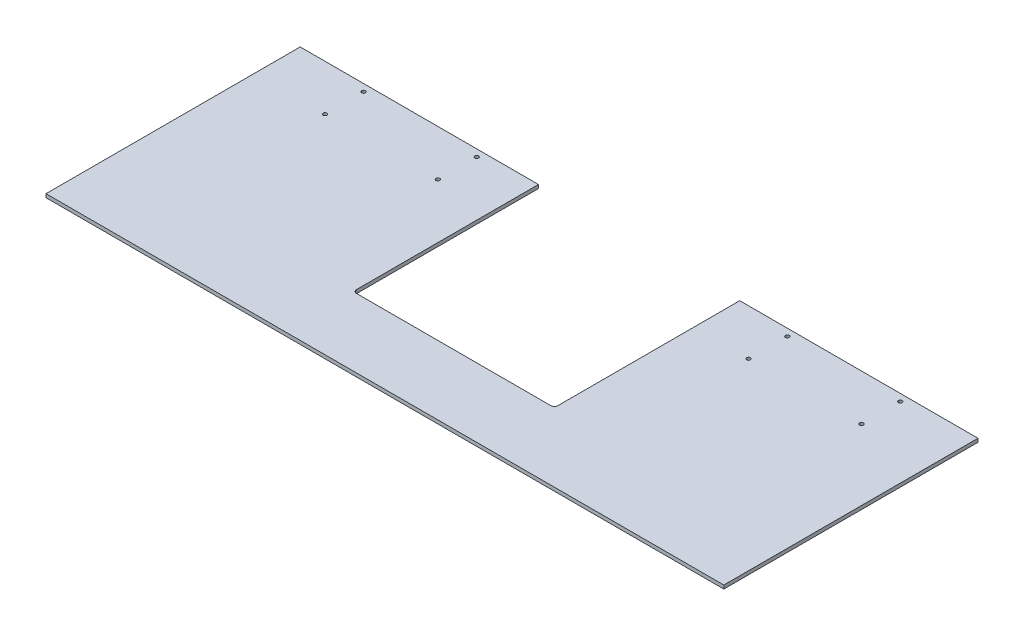
ISO-10303-21;
HEADER;
FILE_DESCRIPTION(('STEP AP214'),'2;1');
FILE_NAME('part.step','',(''),(''),'','','');
FILE_SCHEMA(('AUTOMOTIVE_DESIGN { 1 0 10303 214 1 1 1 1 }'));
ENDSEC;
DATA;
#1=APPLICATION_CONTEXT('core data for automotive mechanical design processes');
#2=APPLICATION_PROTOCOL_DEFINITION('international standard','automotive_design',2000,#1);
#3=PRODUCT_CONTEXT('',#1,'mechanical');
#4=PRODUCT('Part','Part','',(#3));
#5=PRODUCT_RELATED_PRODUCT_CATEGORY('part','',(#4));
#6=PRODUCT_DEFINITION_FORMATION('','',#4);
#7=PRODUCT_DEFINITION_CONTEXT('part definition',#1,'design');
#8=PRODUCT_DEFINITION('design','',#6,#7);
#9=PRODUCT_DEFINITION_SHAPE('','',#8);
#10=(LENGTH_UNIT() NAMED_UNIT(*) SI_UNIT(.MILLI.,.METRE.));
#11=(NAMED_UNIT(*) PLANE_ANGLE_UNIT() SI_UNIT($,.RADIAN.));
#12=(NAMED_UNIT(*) SI_UNIT($,.STERADIAN.) SOLID_ANGLE_UNIT());
#13=UNCERTAINTY_MEASURE_WITH_UNIT(LENGTH_MEASURE(1.E-05),#10,'distance_accuracy_value','');
#14=(GEOMETRIC_REPRESENTATION_CONTEXT(3) GLOBAL_UNCERTAINTY_ASSIGNED_CONTEXT((#13)) GLOBAL_UNIT_ASSIGNED_CONTEXT((#10,
#11,#12)) REPRESENTATION_CONTEXT('',''));
#15=CARTESIAN_POINT('',(0.,0.,0.));
#16=DIRECTION('',(0.,0.,1.));
#17=DIRECTION('',(1.,0.,0.));
#18=AXIS2_PLACEMENT_3D('',#15,#16,#17);
#19=CARTESIAN_POINT('',(609.6,-6.35,-432.563424110412));
#20=DIRECTION('',(0.,0.,1.));
#21=DIRECTION('',(1.,0.,0.));
#22=AXIS2_PLACEMENT_3D('',#19,#20,#21);
#23=PLANE('',#22);
#24=DIRECTION('',(0.,-1.,0.));
#25=VECTOR('',#24,1.);
#26=CARTESIAN_POINT('',(790.575,1340.49866482759,-432.563424110412));
#27=LINE('',#26,#25);
#28=CARTESIAN_POINT('',(790.575,0.,-432.563424110412));
#29=VERTEX_POINT('',#28);
#30=CARTESIAN_POINT('',(790.575,-6.35,-432.563424110412));
#31=VERTEX_POINT('',#30);
#32=EDGE_CURVE('E125',#29,#31,#27,.T.);
#33=ORIENTED_EDGE('',*,*,#32,.F.);
#34=DIRECTION('',(1.,0.,0.));
#35=VECTOR('',#34,1.);
#36=CARTESIAN_POINT('',(609.6,0.,-432.563424110412));
#37=LINE('',#36,#35);
#38=CARTESIAN_POINT('',(1219.2,0.,-432.563424110412));
#39=VERTEX_POINT('',#38);
#40=EDGE_CURVE('E164',#29,#39,#37,.T.);
#41=ORIENTED_EDGE('',*,*,#40,.T.);
#42=DIRECTION('',(0.,1.,0.));
#43=VECTOR('',#42,1.);
#44=CARTESIAN_POINT('',(1219.2,-6.35,-432.563424110412));
#45=LINE('',#44,#43);
#46=CARTESIAN_POINT('',(1219.2,-6.35,-432.563424110412));
#47=VERTEX_POINT('',#46);
#48=EDGE_CURVE('E174',#47,#39,#45,.T.);
#49=ORIENTED_EDGE('',*,*,#48,.F.);
#50=DIRECTION('',(1.,0.,0.));
#51=VECTOR('',#50,1.);
#52=CARTESIAN_POINT('',(609.6,-6.35,-432.563424110412));
#53=LINE('',#52,#51);
#54=EDGE_CURVE('E146',#31,#47,#53,.T.);
#55=ORIENTED_EDGE('',*,*,#54,.F.);
#56=EDGE_LOOP('',(#33,#41,#49,#55));
#57=FACE_BOUND('',#56,.T.);
#58=ADVANCED_FACE('F14',(#57),#23,.F.);
#59=CARTESIAN_POINT('',(609.6,-6.35,-203.963424110413));
#60=DIRECTION('',(0.,-1.,0.));
#61=DIRECTION('',(1.,0.,0.));
#62=AXIS2_PLACEMENT_3D('',#59,#60,#61);
#63=PLANE('',#62);
#64=CARTESIAN_POINT('',(1092.2,-6.35000000000008,-350.013424110413));
#65=DIRECTION('',(0.,-1.,0.));
#66=DIRECTION('',(0.,0.,-1.));
#67=AXIS2_PLACEMENT_3D('',#64,#65,#66);
#68=CIRCLE('',#67,3.36549999999991);
#69=CARTESIAN_POINT('',(1092.2,-6.35000000000008,-353.378924110413));
#70=VERTEX_POINT('',#69);
#71=EDGE_CURVE('E235',#70,#70,#68,.T.);
#72=ORIENTED_EDGE('',*,*,#71,.F.);
#73=EDGE_LOOP('',(#72));
#74=FACE_BOUND('',#73,.T.);
#75=CARTESIAN_POINT('',(1092.2,-6.35000000000008,-419.863424110413));
#76=DIRECTION('',(0.,-1.,0.));
#77=DIRECTION('',(0.,0.,-1.));
#78=AXIS2_PLACEMENT_3D('',#75,#76,#77);
#79=CIRCLE('',#78,3.36549999999991);
#80=CARTESIAN_POINT('',(1092.2,-6.35000000000008,-423.228924110413));
#81=VERTEX_POINT('',#80);
#82=EDGE_CURVE('E230',#81,#81,#79,.T.);
#83=ORIENTED_EDGE('',*,*,#82,.F.);
#84=EDGE_LOOP('',(#83));
#85=FACE_BOUND('',#84,.T.);
#86=CARTESIAN_POINT('',(889.,-6.35000000000008,-419.863424110412));
#87=DIRECTION('',(0.,-1.,0.));
#88=DIRECTION('',(0.,0.,-1.));
#89=AXIS2_PLACEMENT_3D('',#86,#87,#88);
#90=CIRCLE('',#89,3.3655);
#91=CARTESIAN_POINT('',(889.,-6.35000000000008,-423.228924110412));
#92=VERTEX_POINT('',#91);
#93=EDGE_CURVE('E225',#92,#92,#90,.T.);
#94=ORIENTED_EDGE('',*,*,#93,.F.);
#95=EDGE_LOOP('',(#94));
#96=FACE_BOUND('',#95,.T.);
#97=CARTESIAN_POINT('',(889.,-6.35000000000008,-350.013424110413));
#98=DIRECTION('',(0.,-1.,0.));
#99=DIRECTION('',(0.,0.,-1.));
#100=AXIS2_PLACEMENT_3D('',#97,#98,#99);
#101=CIRCLE('',#100,3.3655);
#102=CARTESIAN_POINT('',(889.,-6.35000000000008,-353.378924110413));
#103=VERTEX_POINT('',#102);
#104=EDGE_CURVE('E220',#103,#103,#101,.T.);
#105=ORIENTED_EDGE('',*,*,#104,.F.);
#106=EDGE_LOOP('',(#105));
#107=FACE_BOUND('',#106,.T.);
#108=CARTESIAN_POINT('',(330.2,-6.35000000000008,-350.013424110413));
#109=DIRECTION('',(0.,-1.,0.));
#110=DIRECTION('',(0.,0.,-1.));
#111=AXIS2_PLACEMENT_3D('',#108,#109,#110);
#112=CIRCLE('',#111,3.3655);
#113=CARTESIAN_POINT('',(330.2,-6.35000000000008,-353.378924110413));
#114=VERTEX_POINT('',#113);
#115=EDGE_CURVE('E215',#114,#114,#112,.T.);
#116=ORIENTED_EDGE('',*,*,#115,.F.);
#117=EDGE_LOOP('',(#116));
#118=FACE_BOUND('',#117,.T.);
#119=CARTESIAN_POINT('',(330.2,-6.35000000000008,-419.863424110412));
#120=DIRECTION('',(0.,-1.,0.));
#121=DIRECTION('',(0.,0.,-1.));
#122=AXIS2_PLACEMENT_3D('',#119,#120,#121);
#123=CIRCLE('',#122,3.3655);
#124=CARTESIAN_POINT('',(330.2,-6.35000000000008,-423.228924110412));
#125=VERTEX_POINT('',#124);
#126=EDGE_CURVE('E210',#125,#125,#123,.T.);
#127=ORIENTED_EDGE('',*,*,#126,.F.);
#128=EDGE_LOOP('',(#127));
#129=FACE_BOUND('',#128,.T.);
#130=CARTESIAN_POINT('',(127.,-6.35000000000008,-419.863424110412));
#131=DIRECTION('',(0.,-1.,0.));
#132=DIRECTION('',(0.,0.,-1.));
#133=AXIS2_PLACEMENT_3D('',#130,#131,#132);
#134=CIRCLE('',#133,3.3655);
#135=CARTESIAN_POINT('',(127.,-6.35000000000008,-423.228924110412));
#136=VERTEX_POINT('',#135);
#137=EDGE_CURVE('E205',#136,#136,#134,.T.);
#138=ORIENTED_EDGE('',*,*,#137,.F.);
#139=EDGE_LOOP('',(#138));
#140=FACE_BOUND('',#139,.T.);
#141=CARTESIAN_POINT('',(127.,-6.35000000000008,-350.013424110413));
#142=DIRECTION('',(0.,-1.,0.));
#143=DIRECTION('',(0.,0.,-1.));
#144=AXIS2_PLACEMENT_3D('',#141,#142,#143);
#145=CIRCLE('',#144,3.3655);
#146=CARTESIAN_POINT('',(127.,-6.35000000000008,-353.378924110413));
#147=VERTEX_POINT('',#146);
#148=EDGE_CURVE('E200',#147,#147,#145,.T.);
#149=ORIENTED_EDGE('',*,*,#148,.F.);
#150=EDGE_LOOP('',(#149));
#151=FACE_BOUND('',#150,.T.);
#152=DIRECTION('',(0.,0.,1.));
#153=VECTOR('',#152,1.);
#154=CARTESIAN_POINT('',(428.625,-6.35,-282.531552016735));
#155=LINE('',#154,#153);
#156=CARTESIAN_POINT('',(428.625,-6.35,-432.563424110412));
#157=VERTEX_POINT('',#156);
#158=CARTESIAN_POINT('',(428.625,-6.35,-105.538424110413));
#159=VERTEX_POINT('',#158);
#160=EDGE_CURVE('E117',#157,#159,#155,.T.);
#161=ORIENTED_EDGE('',*,*,#160,.T.);
#162=CARTESIAN_POINT('',(434.975,-6.35000000000008,-105.538424110413));
#163=DIRECTION('',(0.,-1.,0.));
#164=DIRECTION('',(0.,0.,-1.));
#165=AXIS2_PLACEMENT_3D('',#162,#163,#164);
#166=CIRCLE('',#165,6.35);
#167=CARTESIAN_POINT('',(434.975,-6.35,-99.1884241104126));
#168=VERTEX_POINT('',#167);
#169=EDGE_CURVE('E23',#159,#168,#166,.F.);
#170=ORIENTED_EDGE('',*,*,#169,.T.);
#171=DIRECTION('',(1.,0.,0.));
#172=VECTOR('',#171,1.);
#173=CARTESIAN_POINT('',(475.085129356384,-6.35,-99.1884241104126));
#174=LINE('',#173,#172);
#175=CARTESIAN_POINT('',(784.225,-6.35,-99.1884241104126));
#176=VERTEX_POINT('',#175);
#177=EDGE_CURVE('E126',#168,#176,#174,.T.);
#178=ORIENTED_EDGE('',*,*,#177,.T.);
#179=CARTESIAN_POINT('',(784.225,-6.35000000000008,-105.538424110413));
#180=DIRECTION('',(0.,-1.,0.));
#181=DIRECTION('',(0.,0.,-1.));
#182=AXIS2_PLACEMENT_3D('',#179,#180,#181);
#183=CIRCLE('',#182,6.35);
#184=CARTESIAN_POINT('',(790.575,-6.35,-105.538424110413));
#185=VERTEX_POINT('',#184);
#186=EDGE_CURVE('E247',#176,#185,#183,.F.);
#187=ORIENTED_EDGE('',*,*,#186,.T.);
#188=DIRECTION('',(0.,0.,-1.));
#189=VECTOR('',#188,1.);
#190=CARTESIAN_POINT('',(790.575,-6.35,-258.876107633114));
#191=LINE('',#190,#189);
#192=EDGE_CURVE('E199',#185,#31,#191,.T.);
#193=ORIENTED_EDGE('',*,*,#192,.T.);
#194=ORIENTED_EDGE('',*,*,#54,.T.);
#195=DIRECTION('',(0.,0.,-1.));
#196=VECTOR('',#195,1.);
#197=CARTESIAN_POINT('',(1219.2,-6.35,-203.963424110413));
#198=LINE('',#197,#196);
#199=CARTESIAN_POINT('',(1219.2,-6.35,24.6365758895875));
#200=VERTEX_POINT('',#199);
#201=EDGE_CURVE('E145',#200,#47,#198,.T.);
#202=ORIENTED_EDGE('',*,*,#201,.F.);
#203=DIRECTION('',(1.,0.,0.));
#204=VECTOR('',#203,1.);
#205=CARTESIAN_POINT('',(609.6,-6.35,24.6365758895875));
#206=LINE('',#205,#204);
#207=CARTESIAN_POINT('',(0.,-6.35,24.6365758895875));
#208=VERTEX_POINT('',#207);
#209=EDGE_CURVE('E171',#208,#200,#206,.T.);
#210=ORIENTED_EDGE('',*,*,#209,.F.);
#211=DIRECTION('',(0.,0.,-1.));
#212=VECTOR('',#211,1.);
#213=CARTESIAN_POINT('',(0.,-6.35,-203.963424110413));
#214=LINE('',#213,#212);
#215=CARTESIAN_POINT('',(0.,-6.35,-432.563424110412));
#216=VERTEX_POINT('',#215);
#217=EDGE_CURVE('E142',#208,#216,#214,.T.);
#218=ORIENTED_EDGE('',*,*,#217,.T.);
#219=EDGE_CURVE('E133',#216,#157,#53,.T.);
#220=ORIENTED_EDGE('',*,*,#219,.T.);
#221=EDGE_LOOP('',(#161,#170,#178,#187,#193,#194,#202,#210,#218,#220));
#222=FACE_BOUND('',#221,.T.);
#223=ADVANCED_FACE('F139',(#74,#85,#96,#107,#118,#129,#140,#151,#222),#63,.T.);
#224=CARTESIAN_POINT('',(609.6,0.,-203.963424110413));
#225=DIRECTION('',(0.,-1.,0.));
#226=DIRECTION('',(1.,0.,0.));
#227=AXIS2_PLACEMENT_3D('',#224,#225,#226);
#228=PLANE('',#227);
#229=CARTESIAN_POINT('',(1092.2,0.,-350.013424110413));
#230=DIRECTION('',(0.,-1.,0.));
#231=DIRECTION('',(0.,0.,-1.));
#232=AXIS2_PLACEMENT_3D('',#229,#230,#231);
#233=CIRCLE('',#232,3.36549999999991);
#234=CARTESIAN_POINT('',(1092.2,0.,-353.378924110413));
#235=VERTEX_POINT('',#234);
#236=EDGE_CURVE('E231',#235,#235,#233,.F.);
#237=ORIENTED_EDGE('',*,*,#236,.F.);
#238=EDGE_LOOP('',(#237));
#239=FACE_BOUND('',#238,.T.);
#240=CARTESIAN_POINT('',(1092.2,0.,-419.863424110413));
#241=DIRECTION('',(0.,-1.,0.));
#242=DIRECTION('',(0.,0.,-1.));
#243=AXIS2_PLACEMENT_3D('',#240,#241,#242);
#244=CIRCLE('',#243,3.36549999999991);
#245=CARTESIAN_POINT('',(1092.2,0.,-423.228924110413));
#246=VERTEX_POINT('',#245);
#247=EDGE_CURVE('E226',#246,#246,#244,.F.);
#248=ORIENTED_EDGE('',*,*,#247,.F.);
#249=EDGE_LOOP('',(#248));
#250=FACE_BOUND('',#249,.T.);
#251=CARTESIAN_POINT('',(889.,0.,-419.863424110412));
#252=DIRECTION('',(0.,-1.,0.));
#253=DIRECTION('',(0.,0.,-1.));
#254=AXIS2_PLACEMENT_3D('',#251,#252,#253);
#255=CIRCLE('',#254,3.3655);
#256=CARTESIAN_POINT('',(889.,0.,-423.228924110412));
#257=VERTEX_POINT('',#256);
#258=EDGE_CURVE('E221',#257,#257,#255,.F.);
#259=ORIENTED_EDGE('',*,*,#258,.F.);
#260=EDGE_LOOP('',(#259));
#261=FACE_BOUND('',#260,.T.);
#262=CARTESIAN_POINT('',(889.,0.,-350.013424110413));
#263=DIRECTION('',(0.,-1.,0.));
#264=DIRECTION('',(0.,0.,-1.));
#265=AXIS2_PLACEMENT_3D('',#262,#263,#264);
#266=CIRCLE('',#265,3.3655);
#267=CARTESIAN_POINT('',(889.,0.,-353.378924110413));
#268=VERTEX_POINT('',#267);
#269=EDGE_CURVE('E216',#268,#268,#266,.F.);
#270=ORIENTED_EDGE('',*,*,#269,.F.);
#271=EDGE_LOOP('',(#270));
#272=FACE_BOUND('',#271,.T.);
#273=CARTESIAN_POINT('',(330.2,0.,-350.013424110413));
#274=DIRECTION('',(0.,-1.,0.));
#275=DIRECTION('',(0.,0.,-1.));
#276=AXIS2_PLACEMENT_3D('',#273,#274,#275);
#277=CIRCLE('',#276,3.3655);
#278=CARTESIAN_POINT('',(330.2,0.,-353.378924110413));
#279=VERTEX_POINT('',#278);
#280=EDGE_CURVE('E211',#279,#279,#277,.F.);
#281=ORIENTED_EDGE('',*,*,#280,.F.);
#282=EDGE_LOOP('',(#281));
#283=FACE_BOUND('',#282,.T.);
#284=CARTESIAN_POINT('',(330.2,0.,-419.863424110412));
#285=DIRECTION('',(0.,-1.,0.));
#286=DIRECTION('',(0.,0.,-1.));
#287=AXIS2_PLACEMENT_3D('',#284,#285,#286);
#288=CIRCLE('',#287,3.3655);
#289=CARTESIAN_POINT('',(330.2,0.,-423.228924110412));
#290=VERTEX_POINT('',#289);
#291=EDGE_CURVE('E206',#290,#290,#288,.F.);
#292=ORIENTED_EDGE('',*,*,#291,.F.);
#293=EDGE_LOOP('',(#292));
#294=FACE_BOUND('',#293,.T.);
#295=CARTESIAN_POINT('',(127.,0.,-419.863424110412));
#296=DIRECTION('',(0.,-1.,0.));
#297=DIRECTION('',(0.,0.,-1.));
#298=AXIS2_PLACEMENT_3D('',#295,#296,#297);
#299=CIRCLE('',#298,3.3655);
#300=CARTESIAN_POINT('',(127.,0.,-423.228924110412));
#301=VERTEX_POINT('',#300);
#302=EDGE_CURVE('E201',#301,#301,#299,.F.);
#303=ORIENTED_EDGE('',*,*,#302,.F.);
#304=EDGE_LOOP('',(#303));
#305=FACE_BOUND('',#304,.T.);
#306=CARTESIAN_POINT('',(127.,0.,-350.013424110413));
#307=DIRECTION('',(0.,-1.,0.));
#308=DIRECTION('',(0.,0.,-1.));
#309=AXIS2_PLACEMENT_3D('',#306,#307,#308);
#310=CIRCLE('',#309,3.3655);
#311=CARTESIAN_POINT('',(127.,0.,-353.378924110413));
#312=VERTEX_POINT('',#311);
#313=EDGE_CURVE('E195',#312,#312,#310,.F.);
#314=ORIENTED_EDGE('',*,*,#313,.F.);
#315=EDGE_LOOP('',(#314));
#316=FACE_BOUND('',#315,.T.);
#317=DIRECTION('',(0.,0.,-1.));
#318=VECTOR('',#317,1.);
#319=CARTESIAN_POINT('',(790.575,0.,-203.963424110413));
#320=LINE('',#319,#318);
#321=CARTESIAN_POINT('',(790.575,0.,-105.538424110413));
#322=VERTEX_POINT('',#321);
#323=EDGE_CURVE('E191',#322,#29,#320,.T.);
#324=ORIENTED_EDGE('',*,*,#323,.F.);
#325=CARTESIAN_POINT('',(784.225,0.,-105.538424110413));
#326=DIRECTION('',(0.,-1.,0.));
#327=DIRECTION('',(0.,0.,-1.));
#328=AXIS2_PLACEMENT_3D('',#325,#326,#327);
#329=CIRCLE('',#328,6.35);
#330=CARTESIAN_POINT('',(784.225,0.,-99.1884241104126));
#331=VERTEX_POINT('',#330);
#332=EDGE_CURVE('E250',#322,#331,#329,.T.);
#333=ORIENTED_EDGE('',*,*,#332,.T.);
#334=DIRECTION('',(1.,0.,0.));
#335=VECTOR('',#334,1.);
#336=CARTESIAN_POINT('',(609.6,0.,-99.1884241104126));
#337=LINE('',#336,#335);
#338=CARTESIAN_POINT('',(434.975,0.,-99.1884241104126));
#339=VERTEX_POINT('',#338);
#340=EDGE_CURVE('E187',#339,#331,#337,.T.);
#341=ORIENTED_EDGE('',*,*,#340,.F.);
#342=CARTESIAN_POINT('',(434.975,0.,-105.538424110413));
#343=DIRECTION('',(0.,-1.,0.));
#344=DIRECTION('',(0.,0.,-1.));
#345=AXIS2_PLACEMENT_3D('',#342,#343,#344);
#346=CIRCLE('',#345,6.35);
#347=CARTESIAN_POINT('',(428.625,0.,-105.538424110413));
#348=VERTEX_POINT('',#347);
#349=EDGE_CURVE('E9',#339,#348,#346,.T.);
#350=ORIENTED_EDGE('',*,*,#349,.T.);
#351=DIRECTION('',(0.,0.,1.));
#352=VECTOR('',#351,1.);
#353=CARTESIAN_POINT('',(428.625,0.,-203.963424110413));
#354=LINE('',#353,#352);
#355=CARTESIAN_POINT('',(428.625,0.,-432.563424110412));
#356=VERTEX_POINT('',#355);
#357=EDGE_CURVE('E184',#356,#348,#354,.T.);
#358=ORIENTED_EDGE('',*,*,#357,.F.);
#359=CARTESIAN_POINT('',(0.,0.,-432.563424110412));
#360=VERTEX_POINT('',#359);
#361=EDGE_CURVE('E135',#360,#356,#37,.T.);
#362=ORIENTED_EDGE('',*,*,#361,.F.);
#363=DIRECTION('',(0.,0.,-1.));
#364=VECTOR('',#363,1.);
#365=CARTESIAN_POINT('',(0.,0.,-203.963424110413));
#366=LINE('',#365,#364);
#367=CARTESIAN_POINT('',(0.,0.,24.6365758895875));
#368=VERTEX_POINT('',#367);
#369=EDGE_CURVE('E161',#368,#360,#366,.T.);
#370=ORIENTED_EDGE('',*,*,#369,.F.);
#371=DIRECTION('',(1.,0.,0.));
#372=VECTOR('',#371,1.);
#373=CARTESIAN_POINT('',(609.6,0.,24.6365758895875));
#374=LINE('',#373,#372);
#375=CARTESIAN_POINT('',(1219.2,0.,24.6365758895875));
#376=VERTEX_POINT('',#375);
#377=EDGE_CURVE('E137',#368,#376,#374,.T.);
#378=ORIENTED_EDGE('',*,*,#377,.T.);
#379=DIRECTION('',(0.,0.,-1.));
#380=VECTOR('',#379,1.);
#381=CARTESIAN_POINT('',(1219.2,0.,-203.963424110413));
#382=LINE('',#381,#380);
#383=EDGE_CURVE('E167',#376,#39,#382,.T.);
#384=ORIENTED_EDGE('',*,*,#383,.T.);
#385=ORIENTED_EDGE('',*,*,#40,.F.);
#386=EDGE_LOOP('',(#324,#333,#341,#350,#358,#362,#370,#378,#384,#385));
#387=FACE_BOUND('',#386,.T.);
#388=ADVANCED_FACE('F275',(#239,#250,#261,#272,#283,#294,#305,#316,#387),#228,.F.);
#389=CARTESIAN_POINT('',(609.6,-6.35,24.6365758895875));
#390=DIRECTION('',(0.,0.,1.));
#391=DIRECTION('',(1.,0.,0.));
#392=AXIS2_PLACEMENT_3D('',#389,#390,#391);
#393=PLANE('',#392);
#394=ORIENTED_EDGE('',*,*,#377,.F.);
#395=DIRECTION('',(0.,1.,0.));
#396=VECTOR('',#395,1.);
#397=CARTESIAN_POINT('',(0.,-6.35,24.6365758895875));
#398=LINE('',#397,#396);
#399=EDGE_CURVE('E181',#208,#368,#398,.T.);
#400=ORIENTED_EDGE('',*,*,#399,.F.);
#401=ORIENTED_EDGE('',*,*,#209,.T.);
#402=DIRECTION('',(0.,1.,0.));
#403=VECTOR('',#402,1.);
#404=CARTESIAN_POINT('',(1219.2,-6.35,24.6365758895875));
#405=LINE('',#404,#403);
#406=EDGE_CURVE('E153',#200,#376,#405,.T.);
#407=ORIENTED_EDGE('',*,*,#406,.T.);
#408=EDGE_LOOP('',(#394,#400,#401,#407));
#409=FACE_BOUND('',#408,.T.);
#410=ADVANCED_FACE('F290',(#409),#393,.T.);
#411=CARTESIAN_POINT('',(0.,-6.35,-203.963424110413));
#412=DIRECTION('',(1.,0.,0.));
#413=DIRECTION('',(0.,0.,-1.));
#414=AXIS2_PLACEMENT_3D('',#411,#412,#413);
#415=PLANE('',#414);
#416=ORIENTED_EDGE('',*,*,#369,.T.);
#417=DIRECTION('',(0.,1.,0.));
#418=VECTOR('',#417,1.);
#419=CARTESIAN_POINT('',(0.,-6.35,-432.563424110412));
#420=LINE('',#419,#418);
#421=EDGE_CURVE('E178',#216,#360,#420,.T.);
#422=ORIENTED_EDGE('',*,*,#421,.F.);
#423=ORIENTED_EDGE('',*,*,#217,.F.);
#424=ORIENTED_EDGE('',*,*,#399,.T.);
#425=EDGE_LOOP('',(#416,#422,#423,#424));
#426=FACE_BOUND('',#425,.T.);
#427=ADVANCED_FACE('F283',(#426),#415,.F.);
#428=ORIENTED_EDGE('',*,*,#361,.T.);
#429=DIRECTION('',(0.,-1.,0.));
#430=VECTOR('',#429,1.);
#431=CARTESIAN_POINT('',(428.625,1340.49866482759,-432.563424110412));
#432=LINE('',#431,#430);
#433=EDGE_CURVE('E120',#356,#157,#432,.T.);
#434=ORIENTED_EDGE('',*,*,#433,.T.);
#435=ORIENTED_EDGE('',*,*,#219,.F.);
#436=ORIENTED_EDGE('',*,*,#421,.T.);
#437=EDGE_LOOP('',(#428,#434,#435,#436));
#438=FACE_BOUND('',#437,.T.);
#439=ADVANCED_FACE('F131',(#438),#23,.F.);
#440=CARTESIAN_POINT('',(1219.2,-6.35,-203.963424110413));
#441=DIRECTION('',(1.,0.,0.));
#442=DIRECTION('',(0.,0.,-1.));
#443=AXIS2_PLACEMENT_3D('',#440,#441,#442);
#444=PLANE('',#443);
#445=ORIENTED_EDGE('',*,*,#383,.F.);
#446=ORIENTED_EDGE('',*,*,#406,.F.);
#447=ORIENTED_EDGE('',*,*,#201,.T.);
#448=ORIENTED_EDGE('',*,*,#48,.T.);
#449=EDGE_LOOP('',(#445,#446,#447,#448));
#450=FACE_BOUND('',#449,.T.);
#451=ADVANCED_FACE('F282',(#450),#444,.T.);
#452=CARTESIAN_POINT('',(790.575,1340.49866482759,-258.876107633114));
#453=DIRECTION('',(-1.,0.,0.));
#454=DIRECTION('',(0.,0.,1.));
#455=AXIS2_PLACEMENT_3D('',#452,#453,#454);
#456=PLANE('',#455);
#457=ORIENTED_EDGE('',*,*,#192,.F.);
#458=DIRECTION('',(0.,-1.,0.));
#459=VECTOR('',#458,1.);
#460=CARTESIAN_POINT('',(790.575,0.,-105.538424110413));
#461=LINE('',#460,#459);
#462=EDGE_CURVE('E242',#185,#322,#461,.F.);
#463=ORIENTED_EDGE('',*,*,#462,.T.);
#464=ORIENTED_EDGE('',*,*,#323,.T.);
#465=ORIENTED_EDGE('',*,*,#32,.T.);
#466=EDGE_LOOP('',(#457,#463,#464,#465));
#467=FACE_BOUND('',#466,.T.);
#468=ADVANCED_FACE('F288',(#467),#456,.T.);
#469=CARTESIAN_POINT('',(475.085129356384,1340.49866482759,-99.1884241104126));
#470=DIRECTION('',(0.,0.,-1.));
#471=DIRECTION('',(-1.,0.,0.));
#472=AXIS2_PLACEMENT_3D('',#469,#470,#471);
#473=PLANE('',#472);
#474=ORIENTED_EDGE('',*,*,#340,.T.);
#475=DIRECTION('',(0.,-1.,0.));
#476=VECTOR('',#475,1.);
#477=CARTESIAN_POINT('',(784.225,-6.35000000000008,-99.1884241104126));
#478=LINE('',#477,#476);
#479=EDGE_CURVE('E238',#331,#176,#478,.T.);
#480=ORIENTED_EDGE('',*,*,#479,.T.);
#481=ORIENTED_EDGE('',*,*,#177,.F.);
#482=DIRECTION('',(0.,-1.,0.));
#483=VECTOR('',#482,1.);
#484=CARTESIAN_POINT('',(434.975,0.,-99.1884241104126));
#485=LINE('',#484,#483);
#486=EDGE_CURVE('E194',#168,#339,#485,.F.);
#487=ORIENTED_EDGE('',*,*,#486,.T.);
#488=EDGE_LOOP('',(#474,#480,#481,#487));
#489=FACE_BOUND('',#488,.T.);
#490=ADVANCED_FACE('F257',(#489),#473,.T.);
#491=CARTESIAN_POINT('',(428.625,1340.49866482759,-282.531552016735));
#492=DIRECTION('',(1.,0.,0.));
#493=DIRECTION('',(0.,0.,-1.));
#494=AXIS2_PLACEMENT_3D('',#491,#492,#493);
#495=PLANE('',#494);
#496=ORIENTED_EDGE('',*,*,#357,.T.);
#497=DIRECTION('',(0.,-1.,0.));
#498=VECTOR('',#497,1.);
#499=CARTESIAN_POINT('',(428.625,-6.35000000000008,-105.538424110413));
#500=LINE('',#499,#498);
#501=EDGE_CURVE('E121',#348,#159,#500,.T.);
#502=ORIENTED_EDGE('',*,*,#501,.T.);
#503=ORIENTED_EDGE('',*,*,#160,.F.);
#504=ORIENTED_EDGE('',*,*,#433,.F.);
#505=EDGE_LOOP('',(#496,#502,#503,#504));
#506=FACE_BOUND('',#505,.T.);
#507=ADVANCED_FACE('F119',(#506),#495,.T.);
#508=CARTESIAN_POINT('',(127.,1296.78275246943,-350.013424110413));
#509=DIRECTION('',(0.,-1.,0.));
#510=DIRECTION('',(0.,0.,-1.));
#511=AXIS2_PLACEMENT_3D('',#508,#509,#510);
#512=CYLINDRICAL_SURFACE('',#511,3.3655);
#513=ORIENTED_EDGE('',*,*,#148,.T.);
#514=EDGE_LOOP('',(#513));
#515=FACE_BOUND('',#514,.T.);
#516=ORIENTED_EDGE('',*,*,#313,.T.);
#517=EDGE_LOOP('',(#516));
#518=FACE_BOUND('',#517,.T.);
#519=ADVANCED_FACE('F317',(#515,#518),#512,.F.);
#520=CARTESIAN_POINT('',(127.,1296.78275246943,-419.863424110412));
#521=DIRECTION('',(0.,-1.,0.));
#522=DIRECTION('',(0.,0.,-1.));
#523=AXIS2_PLACEMENT_3D('',#520,#521,#522);
#524=CYLINDRICAL_SURFACE('',#523,3.3655);
#525=ORIENTED_EDGE('',*,*,#137,.T.);
#526=EDGE_LOOP('',(#525));
#527=FACE_BOUND('',#526,.T.);
#528=ORIENTED_EDGE('',*,*,#302,.T.);
#529=EDGE_LOOP('',(#528));
#530=FACE_BOUND('',#529,.T.);
#531=ADVANCED_FACE('F320',(#527,#530),#524,.F.);
#532=CARTESIAN_POINT('',(330.2,1296.78275246943,-419.863424110412));
#533=DIRECTION('',(0.,-1.,0.));
#534=DIRECTION('',(0.,0.,-1.));
#535=AXIS2_PLACEMENT_3D('',#532,#533,#534);
#536=CYLINDRICAL_SURFACE('',#535,3.3655);
#537=ORIENTED_EDGE('',*,*,#126,.T.);
#538=EDGE_LOOP('',(#537));
#539=FACE_BOUND('',#538,.T.);
#540=ORIENTED_EDGE('',*,*,#291,.T.);
#541=EDGE_LOOP('',(#540));
#542=FACE_BOUND('',#541,.T.);
#543=ADVANCED_FACE('F324',(#539,#542),#536,.F.);
#544=CARTESIAN_POINT('',(330.2,1296.78275246943,-350.013424110413));
#545=DIRECTION('',(0.,-1.,0.));
#546=DIRECTION('',(0.,0.,-1.));
#547=AXIS2_PLACEMENT_3D('',#544,#545,#546);
#548=CYLINDRICAL_SURFACE('',#547,3.3655);
#549=ORIENTED_EDGE('',*,*,#115,.T.);
#550=EDGE_LOOP('',(#549));
#551=FACE_BOUND('',#550,.T.);
#552=ORIENTED_EDGE('',*,*,#280,.T.);
#553=EDGE_LOOP('',(#552));
#554=FACE_BOUND('',#553,.T.);
#555=ADVANCED_FACE('F328',(#551,#554),#548,.F.);
#556=CARTESIAN_POINT('',(889.,1296.78275246943,-350.013424110413));
#557=DIRECTION('',(0.,-1.,0.));
#558=DIRECTION('',(0.,0.,-1.));
#559=AXIS2_PLACEMENT_3D('',#556,#557,#558);
#560=CYLINDRICAL_SURFACE('',#559,3.3655);
#561=ORIENTED_EDGE('',*,*,#104,.T.);
#562=EDGE_LOOP('',(#561));
#563=FACE_BOUND('',#562,.T.);
#564=ORIENTED_EDGE('',*,*,#269,.T.);
#565=EDGE_LOOP('',(#564));
#566=FACE_BOUND('',#565,.T.);
#567=ADVANCED_FACE('F332',(#563,#566),#560,.F.);
#568=CARTESIAN_POINT('',(889.,1296.78275246943,-419.863424110412));
#569=DIRECTION('',(0.,-1.,0.));
#570=DIRECTION('',(0.,0.,-1.));
#571=AXIS2_PLACEMENT_3D('',#568,#569,#570);
#572=CYLINDRICAL_SURFACE('',#571,3.3655);
#573=ORIENTED_EDGE('',*,*,#93,.T.);
#574=EDGE_LOOP('',(#573));
#575=FACE_BOUND('',#574,.T.);
#576=ORIENTED_EDGE('',*,*,#258,.T.);
#577=EDGE_LOOP('',(#576));
#578=FACE_BOUND('',#577,.T.);
#579=ADVANCED_FACE('F336',(#575,#578),#572,.F.);
#580=CARTESIAN_POINT('',(1092.2,1296.78275246943,-419.863424110413));
#581=DIRECTION('',(0.,-1.,0.));
#582=DIRECTION('',(0.,0.,-1.));
#583=AXIS2_PLACEMENT_3D('',#580,#581,#582);
#584=CYLINDRICAL_SURFACE('',#583,3.36549999999991);
#585=ORIENTED_EDGE('',*,*,#82,.T.);
#586=EDGE_LOOP('',(#585));
#587=FACE_BOUND('',#586,.T.);
#588=ORIENTED_EDGE('',*,*,#247,.T.);
#589=EDGE_LOOP('',(#588));
#590=FACE_BOUND('',#589,.T.);
#591=ADVANCED_FACE('F340',(#587,#590),#584,.F.);
#592=CARTESIAN_POINT('',(1092.2,1296.78275246943,-350.013424110413));
#593=DIRECTION('',(0.,-1.,0.));
#594=DIRECTION('',(0.,0.,-1.));
#595=AXIS2_PLACEMENT_3D('',#592,#593,#594);
#596=CYLINDRICAL_SURFACE('',#595,3.36549999999991);
#597=ORIENTED_EDGE('',*,*,#71,.T.);
#598=EDGE_LOOP('',(#597));
#599=FACE_BOUND('',#598,.T.);
#600=ORIENTED_EDGE('',*,*,#236,.T.);
#601=EDGE_LOOP('',(#600));
#602=FACE_BOUND('',#601,.T.);
#603=ADVANCED_FACE('F267',(#599,#602),#596,.F.);
#604=CARTESIAN_POINT('',(784.225,1340.49866482759,-105.538424110413));
#605=DIRECTION('',(0.,1.,0.));
#606=DIRECTION('',(0.,0.,1.));
#607=AXIS2_PLACEMENT_3D('',#604,#605,#606);
#608=CYLINDRICAL_SURFACE('',#607,6.35);
#609=ORIENTED_EDGE('',*,*,#332,.F.);
#610=ORIENTED_EDGE('',*,*,#462,.F.);
#611=ORIENTED_EDGE('',*,*,#186,.F.);
#612=ORIENTED_EDGE('',*,*,#479,.F.);
#613=EDGE_LOOP('',(#609,#610,#611,#612));
#614=FACE_BOUND('',#613,.T.);
#615=ADVANCED_FACE('F262',(#614),#608,.F.);
#616=CARTESIAN_POINT('',(434.975,1340.49866482759,-105.538424110413));
#617=DIRECTION('',(0.,1.,0.));
#618=DIRECTION('',(0.,0.,1.));
#619=AXIS2_PLACEMENT_3D('',#616,#617,#618);
#620=CYLINDRICAL_SURFACE('',#619,6.35);
#621=ORIENTED_EDGE('',*,*,#349,.F.);
#622=ORIENTED_EDGE('',*,*,#486,.F.);
#623=ORIENTED_EDGE('',*,*,#169,.F.);
#624=ORIENTED_EDGE('',*,*,#501,.F.);
#625=EDGE_LOOP('',(#621,#622,#623,#624));
#626=FACE_BOUND('',#625,.T.);
#627=ADVANCED_FACE('F16',(#626),#620,.F.);
#628=CLOSED_SHELL('',(#58,#223,#388,#410,#427,#439,#451,#468,#490,#507,#519,#531,#543,#555,#567,
#579,#591,#603,#615,#627));
#629=MANIFOLD_SOLID_BREP('B1',#628);
#630=ADVANCED_BREP_SHAPE_REPRESENTATION('',(#18,#629),#14);
#631=SHAPE_DEFINITION_REPRESENTATION(#9,#630);
ENDSEC;
END-ISO-10303-21;
